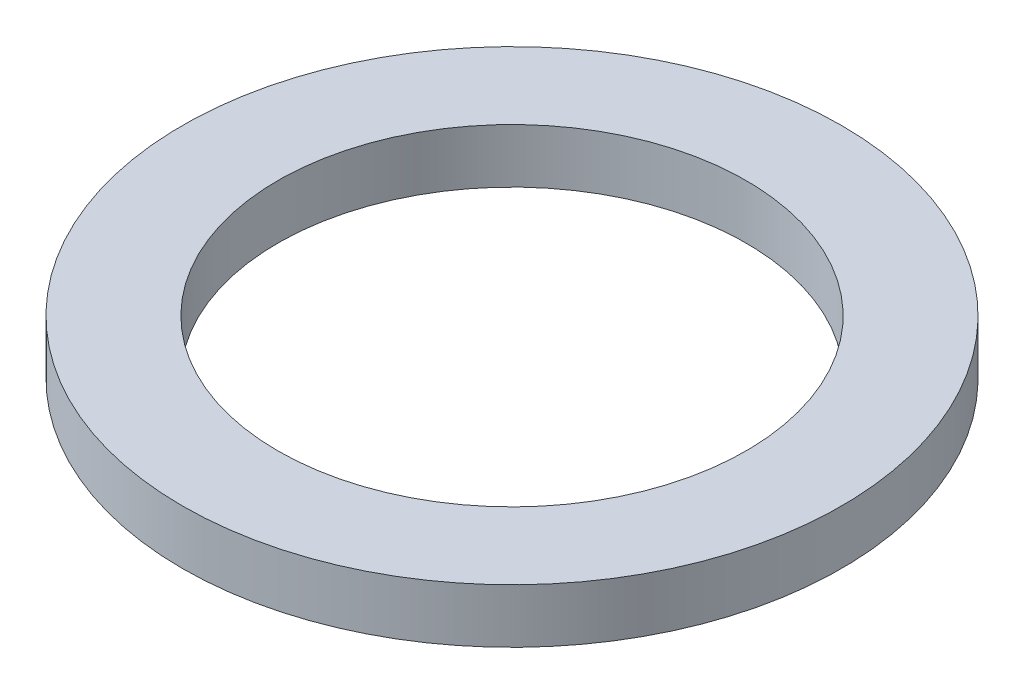
ISO-10303-21;
HEADER;
FILE_DESCRIPTION(('STEP AP214'),'2;1');
FILE_NAME('part.step','',(''),(''),'','','');
FILE_SCHEMA(('AUTOMOTIVE_DESIGN { 1 0 10303 214 1 1 1 1 }'));
ENDSEC;
DATA;
#1=APPLICATION_CONTEXT('core data for automotive mechanical design processes');
#2=APPLICATION_PROTOCOL_DEFINITION('international standard','automotive_design',2000,#1);
#3=PRODUCT_CONTEXT('',#1,'mechanical');
#4=PRODUCT('Part','Part','',(#3));
#5=PRODUCT_RELATED_PRODUCT_CATEGORY('part','',(#4));
#6=PRODUCT_DEFINITION_FORMATION('','',#4);
#7=PRODUCT_DEFINITION_CONTEXT('part definition',#1,'design');
#8=PRODUCT_DEFINITION('design','',#6,#7);
#9=PRODUCT_DEFINITION_SHAPE('','',#8);
#10=(LENGTH_UNIT() NAMED_UNIT(*) SI_UNIT(.MILLI.,.METRE.));
#11=(NAMED_UNIT(*) PLANE_ANGLE_UNIT() SI_UNIT($,.RADIAN.));
#12=(NAMED_UNIT(*) SI_UNIT($,.STERADIAN.) SOLID_ANGLE_UNIT());
#13=UNCERTAINTY_MEASURE_WITH_UNIT(LENGTH_MEASURE(1.E-05),#10,'distance_accuracy_value','');
#14=(GEOMETRIC_REPRESENTATION_CONTEXT(3) GLOBAL_UNCERTAINTY_ASSIGNED_CONTEXT((#13)) GLOBAL_UNIT_ASSIGNED_CONTEXT((#10,
#11,#12)) REPRESENTATION_CONTEXT('',''));
#15=CARTESIAN_POINT('',(0.,0.,0.));
#16=DIRECTION('',(0.,0.,1.));
#17=DIRECTION('',(1.,0.,0.));
#18=AXIS2_PLACEMENT_3D('',#15,#16,#17);
#19=CARTESIAN_POINT('',(0.,0.79375,0.));
#20=DIRECTION('',(0.,1.,0.));
#21=DIRECTION('',(0.,0.,1.));
#22=AXIS2_PLACEMENT_3D('',#19,#20,#21);
#23=PLANE('',#22);
#24=CARTESIAN_POINT('',(0.,0.79375,0.));
#25=DIRECTION('',(0.,1.,0.));
#26=DIRECTION('',(0.,0.,1.));
#27=AXIS2_PLACEMENT_3D('',#24,#25,#26);
#28=CIRCLE('',#27,4.826);
#29=CARTESIAN_POINT('',(0.,0.79375,4.826));
#30=VERTEX_POINT('',#29);
#31=EDGE_CURVE('E10',#30,#30,#28,.T.);
#32=ORIENTED_EDGE('',*,*,#31,.T.);
#33=EDGE_LOOP('',(#32));
#34=FACE_BOUND('',#33,.T.);
#35=CARTESIAN_POINT('',(0.,0.79375,0.));
#36=DIRECTION('',(0.,1.,0.));
#37=DIRECTION('',(0.,0.,1.));
#38=AXIS2_PLACEMENT_3D('',#35,#36,#37);
#39=CIRCLE('',#38,3.429);
#40=CARTESIAN_POINT('',(0.,0.79375,3.429));
#41=VERTEX_POINT('',#40);
#42=EDGE_CURVE('E58',#41,#41,#39,.T.);
#43=ORIENTED_EDGE('',*,*,#42,.F.);
#44=EDGE_LOOP('',(#43));
#45=FACE_BOUND('',#44,.T.);
#46=ADVANCED_FACE('F45',(#34,#45),#23,.T.);
#47=CARTESIAN_POINT('',(0.,0.,0.));
#48=DIRECTION('',(0.,1.,0.));
#49=DIRECTION('',(0.,0.,1.));
#50=AXIS2_PLACEMENT_3D('',#47,#48,#49);
#51=PLANE('',#50);
#52=CARTESIAN_POINT('',(0.,0.,0.));
#53=DIRECTION('',(0.,1.,0.));
#54=DIRECTION('',(0.,0.,1.));
#55=AXIS2_PLACEMENT_3D('',#52,#53,#54);
#56=CIRCLE('',#55,4.826);
#57=CARTESIAN_POINT('',(0.,0.,4.826));
#58=VERTEX_POINT('',#57);
#59=EDGE_CURVE('E49',#58,#58,#56,.T.);
#60=ORIENTED_EDGE('',*,*,#59,.F.);
#61=EDGE_LOOP('',(#60));
#62=FACE_BOUND('',#61,.T.);
#63=CARTESIAN_POINT('',(0.,0.,0.));
#64=DIRECTION('',(0.,1.,0.));
#65=DIRECTION('',(0.,0.,1.));
#66=AXIS2_PLACEMENT_3D('',#63,#64,#65);
#67=CIRCLE('',#66,3.429);
#68=CARTESIAN_POINT('',(0.,0.,3.429));
#69=VERTEX_POINT('',#68);
#70=EDGE_CURVE('E60',#69,#69,#67,.T.);
#71=ORIENTED_EDGE('',*,*,#70,.T.);
#72=EDGE_LOOP('',(#71));
#73=FACE_BOUND('',#72,.T.);
#74=ADVANCED_FACE('F72',(#62,#73),#51,.F.);
#75=CARTESIAN_POINT('',(0.,0.79375,0.));
#76=DIRECTION('',(0.,-1.,0.));
#77=DIRECTION('',(0.,0.,-1.));
#78=AXIS2_PLACEMENT_3D('',#75,#76,#77);
#79=CYLINDRICAL_SURFACE('',#78,4.826);
#80=ORIENTED_EDGE('',*,*,#31,.F.);
#81=EDGE_LOOP('',(#80));
#82=FACE_BOUND('',#81,.T.);
#83=ORIENTED_EDGE('',*,*,#59,.T.);
#84=EDGE_LOOP('',(#83));
#85=FACE_BOUND('',#84,.T.);
#86=ADVANCED_FACE('F47',(#82,#85),#79,.T.);
#87=CARTESIAN_POINT('',(0.,0.79375,0.));
#88=DIRECTION('',(0.,-1.,0.));
#89=DIRECTION('',(0.,0.,-1.));
#90=AXIS2_PLACEMENT_3D('',#87,#88,#89);
#91=CYLINDRICAL_SURFACE('',#90,3.429);
#92=ORIENTED_EDGE('',*,*,#42,.T.);
#93=EDGE_LOOP('',(#92));
#94=FACE_BOUND('',#93,.T.);
#95=ORIENTED_EDGE('',*,*,#70,.F.);
#96=EDGE_LOOP('',(#95));
#97=FACE_BOUND('',#96,.T.);
#98=ADVANCED_FACE('F68',(#94,#97),#91,.F.);
#99=CLOSED_SHELL('',(#46,#74,#86,#98));
#100=MANIFOLD_SOLID_BREP('B2',#99);
#101=ADVANCED_BREP_SHAPE_REPRESENTATION('',(#18,#100),#14);
#102=SHAPE_DEFINITION_REPRESENTATION(#9,#101);
ENDSEC;
END-ISO-10303-21;
